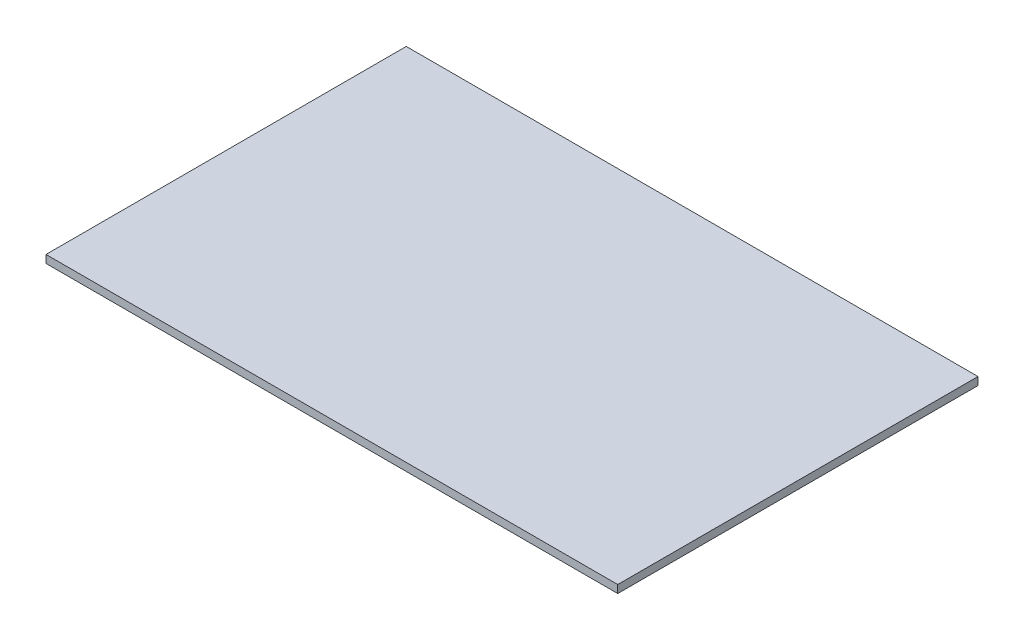
ISO-10303-21;
HEADER;
FILE_DESCRIPTION(('STEP AP214'),'2;1');
FILE_NAME('part.step','',(''),(''),'','','');
FILE_SCHEMA(('AUTOMOTIVE_DESIGN { 1 0 10303 214 1 1 1 1 }'));
ENDSEC;
DATA;
#1=APPLICATION_CONTEXT('core data for automotive mechanical design processes');
#2=APPLICATION_PROTOCOL_DEFINITION('international standard','automotive_design',2000,#1);
#3=PRODUCT_CONTEXT('',#1,'mechanical');
#4=PRODUCT('Part','Part','',(#3));
#5=PRODUCT_RELATED_PRODUCT_CATEGORY('part','',(#4));
#6=PRODUCT_DEFINITION_FORMATION('','',#4);
#7=PRODUCT_DEFINITION_CONTEXT('part definition',#1,'design');
#8=PRODUCT_DEFINITION('design','',#6,#7);
#9=PRODUCT_DEFINITION_SHAPE('','',#8);
#10=(LENGTH_UNIT() NAMED_UNIT(*) SI_UNIT(.MILLI.,.METRE.));
#11=(NAMED_UNIT(*) PLANE_ANGLE_UNIT() SI_UNIT($,.RADIAN.));
#12=(NAMED_UNIT(*) SI_UNIT($,.STERADIAN.) SOLID_ANGLE_UNIT());
#13=UNCERTAINTY_MEASURE_WITH_UNIT(LENGTH_MEASURE(1.E-05),#10,'distance_accuracy_value','');
#14=(GEOMETRIC_REPRESENTATION_CONTEXT(3) GLOBAL_UNCERTAINTY_ASSIGNED_CONTEXT((#13)) GLOBAL_UNIT_ASSIGNED_CONTEXT((#10,
#11,#12)) REPRESENTATION_CONTEXT('',''));
#15=CARTESIAN_POINT('',(0.,0.,0.));
#16=DIRECTION('',(0.,0.,1.));
#17=DIRECTION('',(1.,0.,0.));
#18=AXIS2_PLACEMENT_3D('',#15,#16,#17);
#19=CARTESIAN_POINT('',(36.5,1.,-23.));
#20=DIRECTION('',(-1.,0.,0.));
#21=DIRECTION('',(0.,0.,1.));
#22=AXIS2_PLACEMENT_3D('',#19,#20,#21);
#23=PLANE('',#22);
#24=DIRECTION('',(0.,0.,-1.));
#25=VECTOR('',#24,1.);
#26=CARTESIAN_POINT('',(36.5,0.,-23.));
#27=LINE('',#26,#25);
#28=CARTESIAN_POINT('',(36.5,0.,23.));
#29=VERTEX_POINT('',#28);
#30=CARTESIAN_POINT('',(36.5,0.,-23.));
#31=VERTEX_POINT('',#30);
#32=EDGE_CURVE('E113',#29,#31,#27,.T.);
#33=ORIENTED_EDGE('',*,*,#32,.T.);
#34=DIRECTION('',(0.,-1.,0.));
#35=VECTOR('',#34,1.);
#36=CARTESIAN_POINT('',(36.5,1.,-23.));
#37=LINE('',#36,#35);
#38=CARTESIAN_POINT('',(36.5,1.,-23.));
#39=VERTEX_POINT('',#38);
#40=EDGE_CURVE('E11',#39,#31,#37,.T.);
#41=ORIENTED_EDGE('',*,*,#40,.F.);
#42=DIRECTION('',(0.,0.,-1.));
#43=VECTOR('',#42,1.);
#44=CARTESIAN_POINT('',(36.5,1.,-23.));
#45=LINE('',#44,#43);
#46=CARTESIAN_POINT('',(36.5,1.,23.));
#47=VERTEX_POINT('',#46);
#48=EDGE_CURVE('E97',#47,#39,#45,.T.);
#49=ORIENTED_EDGE('',*,*,#48,.F.);
#50=DIRECTION('',(0.,-1.,0.));
#51=VECTOR('',#50,1.);
#52=CARTESIAN_POINT('',(36.5,1.,23.));
#53=LINE('',#52,#51);
#54=EDGE_CURVE('E109',#47,#29,#53,.T.);
#55=ORIENTED_EDGE('',*,*,#54,.T.);
#56=EDGE_LOOP('',(#33,#41,#49,#55));
#57=FACE_BOUND('',#56,.T.);
#58=ADVANCED_FACE('F45',(#57),#23,.F.);
#59=CARTESIAN_POINT('',(-36.5,1.,-23.));
#60=DIRECTION('',(0.,0.,1.));
#61=DIRECTION('',(1.,0.,0.));
#62=AXIS2_PLACEMENT_3D('',#59,#60,#61);
#63=PLANE('',#62);
#64=DIRECTION('',(-1.,0.,0.));
#65=VECTOR('',#64,1.);
#66=CARTESIAN_POINT('',(-36.5,0.,-23.));
#67=LINE('',#66,#65);
#68=CARTESIAN_POINT('',(-36.5,0.,-23.));
#69=VERTEX_POINT('',#68);
#70=EDGE_CURVE('E102',#31,#69,#67,.T.);
#71=ORIENTED_EDGE('',*,*,#70,.T.);
#72=DIRECTION('',(0.,-1.,0.));
#73=VECTOR('',#72,1.);
#74=CARTESIAN_POINT('',(-36.5,1.,-23.));
#75=LINE('',#74,#73);
#76=CARTESIAN_POINT('',(-36.5,1.,-23.));
#77=VERTEX_POINT('',#76);
#78=EDGE_CURVE('E54',#77,#69,#75,.T.);
#79=ORIENTED_EDGE('',*,*,#78,.F.);
#80=DIRECTION('',(-1.,0.,0.));
#81=VECTOR('',#80,1.);
#82=CARTESIAN_POINT('',(-36.5,1.,-23.));
#83=LINE('',#82,#81);
#84=EDGE_CURVE('E92',#39,#77,#83,.T.);
#85=ORIENTED_EDGE('',*,*,#84,.F.);
#86=ORIENTED_EDGE('',*,*,#40,.T.);
#87=EDGE_LOOP('',(#71,#79,#85,#86));
#88=FACE_BOUND('',#87,.T.);
#89=ADVANCED_FACE('F101',(#88),#63,.F.);
#90=CARTESIAN_POINT('',(-36.5,1.,-23.));
#91=DIRECTION('',(1.,0.,0.));
#92=DIRECTION('',(0.,0.,-1.));
#93=AXIS2_PLACEMENT_3D('',#90,#91,#92);
#94=PLANE('',#93);
#95=DIRECTION('',(0.,0.,1.));
#96=VECTOR('',#95,1.);
#97=CARTESIAN_POINT('',(-36.5,0.,-23.));
#98=LINE('',#97,#96);
#99=CARTESIAN_POINT('',(-36.5,0.,23.));
#100=VERTEX_POINT('',#99);
#101=EDGE_CURVE('E79',#69,#100,#98,.T.);
#102=ORIENTED_EDGE('',*,*,#101,.T.);
#103=DIRECTION('',(0.,-1.,0.));
#104=VECTOR('',#103,1.);
#105=CARTESIAN_POINT('',(-36.5,1.,23.));
#106=LINE('',#105,#104);
#107=CARTESIAN_POINT('',(-36.5,1.,23.));
#108=VERTEX_POINT('',#107);
#109=EDGE_CURVE('E104',#108,#100,#106,.T.);
#110=ORIENTED_EDGE('',*,*,#109,.F.);
#111=DIRECTION('',(0.,0.,1.));
#112=VECTOR('',#111,1.);
#113=CARTESIAN_POINT('',(-36.5,1.,-23.));
#114=LINE('',#113,#112);
#115=EDGE_CURVE('E95',#77,#108,#114,.T.);
#116=ORIENTED_EDGE('',*,*,#115,.F.);
#117=ORIENTED_EDGE('',*,*,#78,.T.);
#118=EDGE_LOOP('',(#102,#110,#116,#117));
#119=FACE_BOUND('',#118,.T.);
#120=ADVANCED_FACE('F105',(#119),#94,.F.);
#121=CARTESIAN_POINT('',(-36.5,1.,23.));
#122=DIRECTION('',(0.,0.,-1.));
#123=DIRECTION('',(-1.,0.,0.));
#124=AXIS2_PLACEMENT_3D('',#121,#122,#123);
#125=PLANE('',#124);
#126=DIRECTION('',(1.,0.,0.));
#127=VECTOR('',#126,1.);
#128=CARTESIAN_POINT('',(-36.5,0.,23.));
#129=LINE('',#128,#127);
#130=EDGE_CURVE('E85',#100,#29,#129,.T.);
#131=ORIENTED_EDGE('',*,*,#130,.T.);
#132=ORIENTED_EDGE('',*,*,#54,.F.);
#133=DIRECTION('',(1.,0.,0.));
#134=VECTOR('',#133,1.);
#135=CARTESIAN_POINT('',(-36.5,1.,23.));
#136=LINE('',#135,#134);
#137=EDGE_CURVE('E62',#108,#47,#136,.T.);
#138=ORIENTED_EDGE('',*,*,#137,.F.);
#139=ORIENTED_EDGE('',*,*,#109,.T.);
#140=EDGE_LOOP('',(#131,#132,#138,#139));
#141=FACE_BOUND('',#140,.T.);
#142=ADVANCED_FACE('F126',(#141),#125,.F.);
#143=CARTESIAN_POINT('',(0.,1.,0.));
#144=DIRECTION('',(0.,1.,0.));
#145=DIRECTION('',(0.,0.,1.));
#146=AXIS2_PLACEMENT_3D('',#143,#144,#145);
#147=PLANE('',#146);
#148=ORIENTED_EDGE('',*,*,#48,.T.);
#149=ORIENTED_EDGE('',*,*,#84,.T.);
#150=ORIENTED_EDGE('',*,*,#115,.T.);
#151=ORIENTED_EDGE('',*,*,#137,.T.);
#152=EDGE_LOOP('',(#148,#149,#150,#151));
#153=FACE_BOUND('',#152,.T.);
#154=ADVANCED_FACE('F93',(#153),#147,.T.);
#155=CARTESIAN_POINT('',(0.,0.,0.));
#156=DIRECTION('',(0.,1.,0.));
#157=DIRECTION('',(0.,0.,1.));
#158=AXIS2_PLACEMENT_3D('',#155,#156,#157);
#159=PLANE('',#158);
#160=ORIENTED_EDGE('',*,*,#32,.F.);
#161=ORIENTED_EDGE('',*,*,#130,.F.);
#162=ORIENTED_EDGE('',*,*,#101,.F.);
#163=ORIENTED_EDGE('',*,*,#70,.F.);
#164=EDGE_LOOP('',(#160,#161,#162,#163));
#165=FACE_BOUND('',#164,.T.);
#166=ADVANCED_FACE('F129',(#165),#159,.F.);
#167=CLOSED_SHELL('',(#58,#89,#120,#142,#154,#166));
#168=MANIFOLD_SOLID_BREP('B2',#167);
#169=ADVANCED_BREP_SHAPE_REPRESENTATION('',(#18,#168),#14);
#170=SHAPE_DEFINITION_REPRESENTATION(#9,#169);
ENDSEC;
END-ISO-10303-21;
